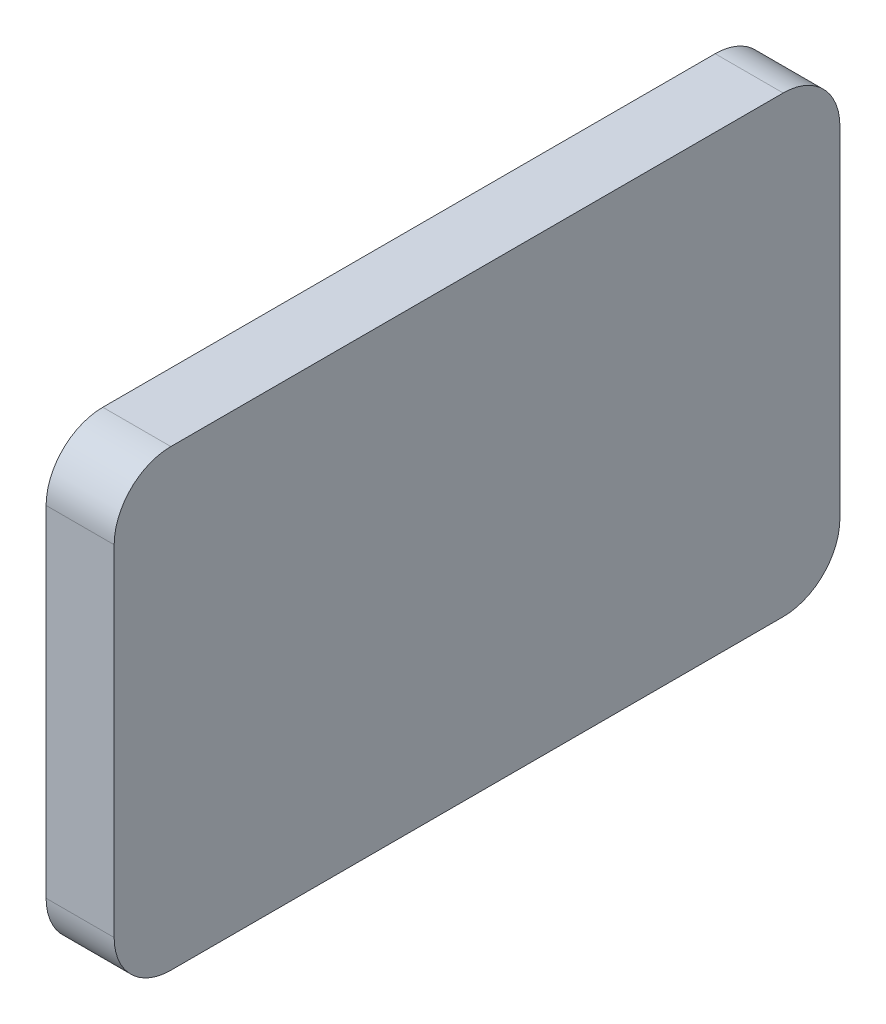
ISO-10303-21;
HEADER;
FILE_DESCRIPTION(('STEP AP214'),'2;1');
FILE_NAME('part.step','',(''),(''),'','','');
FILE_SCHEMA(('AUTOMOTIVE_DESIGN { 1 0 10303 214 1 1 1 1 }'));
ENDSEC;
DATA;
#1=APPLICATION_CONTEXT('core data for automotive mechanical design processes');
#2=APPLICATION_PROTOCOL_DEFINITION('international standard','automotive_design',2000,#1);
#3=PRODUCT_CONTEXT('',#1,'mechanical');
#4=PRODUCT('Part','Part','',(#3));
#5=PRODUCT_RELATED_PRODUCT_CATEGORY('part','',(#4));
#6=PRODUCT_DEFINITION_FORMATION('','',#4);
#7=PRODUCT_DEFINITION_CONTEXT('part definition',#1,'design');
#8=PRODUCT_DEFINITION('design','',#6,#7);
#9=PRODUCT_DEFINITION_SHAPE('','',#8);
#10=(LENGTH_UNIT() NAMED_UNIT(*) SI_UNIT(.MILLI.,.METRE.));
#11=(NAMED_UNIT(*) PLANE_ANGLE_UNIT() SI_UNIT($,.RADIAN.));
#12=(NAMED_UNIT(*) SI_UNIT($,.STERADIAN.) SOLID_ANGLE_UNIT());
#13=UNCERTAINTY_MEASURE_WITH_UNIT(LENGTH_MEASURE(1.E-05),#10,'distance_accuracy_value','');
#14=(GEOMETRIC_REPRESENTATION_CONTEXT(3) GLOBAL_UNCERTAINTY_ASSIGNED_CONTEXT((#13)) GLOBAL_UNIT_ASSIGNED_CONTEXT((#10,
#11,#12)) REPRESENTATION_CONTEXT('',''));
#15=CARTESIAN_POINT('',(0.,0.,0.));
#16=DIRECTION('',(0.,0.,1.));
#17=DIRECTION('',(1.,0.,0.));
#18=AXIS2_PLACEMENT_3D('',#15,#16,#17);
#19=CARTESIAN_POINT('',(6.,15.,-27.));
#20=DIRECTION('',(-1.,0.,0.));
#21=DIRECTION('',(0.,0.,1.));
#22=AXIS2_PLACEMENT_3D('',#19,#20,#21);
#23=CYLINDRICAL_SURFACE('',#22,5.00000000000001);
#24=CARTESIAN_POINT('',(0.,15.,-27.));
#25=DIRECTION('',(1.,0.,0.));
#26=DIRECTION('',(0.,0.,1.));
#27=AXIS2_PLACEMENT_3D('',#24,#25,#26);
#28=CIRCLE('',#27,5.00000000000001);
#29=CARTESIAN_POINT('',(0.,15.,-32.));
#30=VERTEX_POINT('',#29);
#31=CARTESIAN_POINT('',(0.,20.,-27.));
#32=VERTEX_POINT('',#31);
#33=EDGE_CURVE('E131',#30,#32,#28,.T.);
#34=ORIENTED_EDGE('',*,*,#33,.T.);
#35=DIRECTION('',(-1.,0.,0.));
#36=VECTOR('',#35,1.);
#37=CARTESIAN_POINT('',(6.,20.,-27.));
#38=LINE('',#37,#36);
#39=CARTESIAN_POINT('',(6.,20.,-27.));
#40=VERTEX_POINT('',#39);
#41=EDGE_CURVE('E11',#40,#32,#38,.T.);
#42=ORIENTED_EDGE('',*,*,#41,.F.);
#43=CARTESIAN_POINT('',(6.,15.,-27.));
#44=DIRECTION('',(1.,0.,0.));
#45=DIRECTION('',(0.,0.,1.));
#46=AXIS2_PLACEMENT_3D('',#43,#44,#45);
#47=CIRCLE('',#46,5.00000000000001);
#48=CARTESIAN_POINT('',(6.,15.,-32.));
#49=VERTEX_POINT('',#48);
#50=EDGE_CURVE('E145',#49,#40,#47,.T.);
#51=ORIENTED_EDGE('',*,*,#50,.F.);
#52=DIRECTION('',(-1.,0.,0.));
#53=VECTOR('',#52,1.);
#54=CARTESIAN_POINT('',(6.,15.,-32.));
#55=LINE('',#54,#53);
#56=EDGE_CURVE('E127',#49,#30,#55,.T.);
#57=ORIENTED_EDGE('',*,*,#56,.T.);
#58=EDGE_LOOP('',(#34,#42,#51,#57));
#59=FACE_BOUND('',#58,.T.);
#60=ADVANCED_FACE('F35',(#59),#23,.T.);
#61=CARTESIAN_POINT('',(6.,20.,27.));
#62=DIRECTION('',(0.,-1.,0.));
#63=DIRECTION('',(0.,0.,-1.));
#64=AXIS2_PLACEMENT_3D('',#61,#62,#63);
#65=PLANE('',#64);
#66=DIRECTION('',(0.,0.,1.));
#67=VECTOR('',#66,1.);
#68=CARTESIAN_POINT('',(0.,20.,27.));
#69=LINE('',#68,#67);
#70=CARTESIAN_POINT('',(0.,20.,27.));
#71=VERTEX_POINT('',#70);
#72=EDGE_CURVE('E134',#32,#71,#69,.T.);
#73=ORIENTED_EDGE('',*,*,#72,.T.);
#74=DIRECTION('',(-1.,0.,0.));
#75=VECTOR('',#74,1.);
#76=CARTESIAN_POINT('',(6.,20.,27.));
#77=LINE('',#76,#75);
#78=CARTESIAN_POINT('',(6.,20.,27.));
#79=VERTEX_POINT('',#78);
#80=EDGE_CURVE('E43',#79,#71,#77,.T.);
#81=ORIENTED_EDGE('',*,*,#80,.F.);
#82=DIRECTION('',(0.,0.,1.));
#83=VECTOR('',#82,1.);
#84=CARTESIAN_POINT('',(6.,20.,27.));
#85=LINE('',#84,#83);
#86=EDGE_CURVE('E94',#40,#79,#85,.T.);
#87=ORIENTED_EDGE('',*,*,#86,.F.);
#88=ORIENTED_EDGE('',*,*,#41,.T.);
#89=EDGE_LOOP('',(#73,#81,#87,#88));
#90=FACE_BOUND('',#89,.T.);
#91=ADVANCED_FACE('F180',(#90),#65,.F.);
#92=CARTESIAN_POINT('',(6.,15.,27.));
#93=DIRECTION('',(-1.,0.,0.));
#94=DIRECTION('',(0.,0.,1.));
#95=AXIS2_PLACEMENT_3D('',#92,#93,#94);
#96=CYLINDRICAL_SURFACE('',#95,5.);
#97=CARTESIAN_POINT('',(0.,15.,27.));
#98=DIRECTION('',(1.,0.,0.));
#99=DIRECTION('',(0.,0.,1.));
#100=AXIS2_PLACEMENT_3D('',#97,#98,#99);
#101=CIRCLE('',#100,5.);
#102=CARTESIAN_POINT('',(0.,15.,32.));
#103=VERTEX_POINT('',#102);
#104=EDGE_CURVE('E136',#71,#103,#101,.T.);
#105=ORIENTED_EDGE('',*,*,#104,.T.);
#106=DIRECTION('',(-1.,0.,0.));
#107=VECTOR('',#106,1.);
#108=CARTESIAN_POINT('',(6.,15.,32.));
#109=LINE('',#108,#107);
#110=CARTESIAN_POINT('',(6.,15.,32.));
#111=VERTEX_POINT('',#110);
#112=EDGE_CURVE('E152',#111,#103,#109,.T.);
#113=ORIENTED_EDGE('',*,*,#112,.F.);
#114=CARTESIAN_POINT('',(6.,15.,27.));
#115=DIRECTION('',(1.,0.,0.));
#116=DIRECTION('',(0.,0.,1.));
#117=AXIS2_PLACEMENT_3D('',#114,#115,#116);
#118=CIRCLE('',#117,5.);
#119=EDGE_CURVE('E160',#79,#111,#118,.T.);
#120=ORIENTED_EDGE('',*,*,#119,.F.);
#121=ORIENTED_EDGE('',*,*,#80,.T.);
#122=EDGE_LOOP('',(#105,#113,#120,#121));
#123=FACE_BOUND('',#122,.T.);
#124=ADVANCED_FACE('F158',(#123),#96,.T.);
#125=CARTESIAN_POINT('',(6.,15.,32.));
#126=DIRECTION('',(0.,0.,-1.));
#127=DIRECTION('',(-1.,0.,0.));
#128=AXIS2_PLACEMENT_3D('',#125,#126,#127);
#129=PLANE('',#128);
#130=DIRECTION('',(0.,-1.,0.));
#131=VECTOR('',#130,1.);
#132=CARTESIAN_POINT('',(0.,15.,32.));
#133=LINE('',#132,#131);
#134=CARTESIAN_POINT('',(0.,-15.,32.));
#135=VERTEX_POINT('',#134);
#136=EDGE_CURVE('E138',#103,#135,#133,.T.);
#137=ORIENTED_EDGE('',*,*,#136,.T.);
#138=DIRECTION('',(-1.,0.,0.));
#139=VECTOR('',#138,1.);
#140=CARTESIAN_POINT('',(6.,-15.,32.));
#141=LINE('',#140,#139);
#142=CARTESIAN_POINT('',(6.,-15.,32.));
#143=VERTEX_POINT('',#142);
#144=EDGE_CURVE('E149',#143,#135,#141,.T.);
#145=ORIENTED_EDGE('',*,*,#144,.F.);
#146=DIRECTION('',(0.,-1.,0.));
#147=VECTOR('',#146,1.);
#148=CARTESIAN_POINT('',(6.,15.,32.));
#149=LINE('',#148,#147);
#150=EDGE_CURVE('E172',#111,#143,#149,.T.);
#151=ORIENTED_EDGE('',*,*,#150,.F.);
#152=ORIENTED_EDGE('',*,*,#112,.T.);
#153=EDGE_LOOP('',(#137,#145,#151,#152));
#154=FACE_BOUND('',#153,.T.);
#155=ADVANCED_FACE('F168',(#154),#129,.F.);
#156=CARTESIAN_POINT('',(6.,-15.,27.));
#157=DIRECTION('',(-1.,0.,0.));
#158=DIRECTION('',(0.,0.,1.));
#159=AXIS2_PLACEMENT_3D('',#156,#157,#158);
#160=CYLINDRICAL_SURFACE('',#159,5.);
#161=CARTESIAN_POINT('',(0.,-15.,27.));
#162=DIRECTION('',(1.,0.,0.));
#163=DIRECTION('',(0.,0.,1.));
#164=AXIS2_PLACEMENT_3D('',#161,#162,#163);
#165=CIRCLE('',#164,5.);
#166=CARTESIAN_POINT('',(0.,-20.,27.));
#167=VERTEX_POINT('',#166);
#168=EDGE_CURVE('E140',#135,#167,#165,.T.);
#169=ORIENTED_EDGE('',*,*,#168,.T.);
#170=DIRECTION('',(-1.,0.,0.));
#171=VECTOR('',#170,1.);
#172=CARTESIAN_POINT('',(6.,-20.,27.));
#173=LINE('',#172,#171);
#174=CARTESIAN_POINT('',(6.,-20.,27.));
#175=VERTEX_POINT('',#174);
#176=EDGE_CURVE('E122',#175,#167,#173,.T.);
#177=ORIENTED_EDGE('',*,*,#176,.F.);
#178=CARTESIAN_POINT('',(6.,-15.,27.));
#179=DIRECTION('',(1.,0.,0.));
#180=DIRECTION('',(0.,0.,1.));
#181=AXIS2_PLACEMENT_3D('',#178,#179,#180);
#182=CIRCLE('',#181,5.);
#183=EDGE_CURVE('E113',#143,#175,#182,.T.);
#184=ORIENTED_EDGE('',*,*,#183,.F.);
#185=ORIENTED_EDGE('',*,*,#144,.T.);
#186=EDGE_LOOP('',(#169,#177,#184,#185));
#187=FACE_BOUND('',#186,.T.);
#188=ADVANCED_FACE('F171',(#187),#160,.T.);
#189=CARTESIAN_POINT('',(6.,-20.,27.));
#190=DIRECTION('',(0.,1.,0.));
#191=DIRECTION('',(0.,0.,1.));
#192=AXIS2_PLACEMENT_3D('',#189,#190,#191);
#193=PLANE('',#192);
#194=DIRECTION('',(0.,0.,-1.));
#195=VECTOR('',#194,1.);
#196=CARTESIAN_POINT('',(0.,-20.,27.));
#197=LINE('',#196,#195);
#198=CARTESIAN_POINT('',(0.,-20.,-27.));
#199=VERTEX_POINT('',#198);
#200=EDGE_CURVE('E121',#167,#199,#197,.T.);
#201=ORIENTED_EDGE('',*,*,#200,.T.);
#202=DIRECTION('',(-1.,0.,0.));
#203=VECTOR('',#202,1.);
#204=CARTESIAN_POINT('',(6.,-20.,-27.));
#205=LINE('',#204,#203);
#206=CARTESIAN_POINT('',(6.,-20.,-27.));
#207=VERTEX_POINT('',#206);
#208=EDGE_CURVE('E118',#207,#199,#205,.T.);
#209=ORIENTED_EDGE('',*,*,#208,.F.);
#210=DIRECTION('',(0.,0.,-1.));
#211=VECTOR('',#210,1.);
#212=CARTESIAN_POINT('',(6.,-20.,27.));
#213=LINE('',#212,#211);
#214=EDGE_CURVE('E107',#175,#207,#213,.T.);
#215=ORIENTED_EDGE('',*,*,#214,.F.);
#216=ORIENTED_EDGE('',*,*,#176,.T.);
#217=EDGE_LOOP('',(#201,#209,#215,#216));
#218=FACE_BOUND('',#217,.T.);
#219=ADVANCED_FACE('F119',(#218),#193,.F.);
#220=CARTESIAN_POINT('',(6.,-15.,-27.));
#221=DIRECTION('',(-1.,0.,0.));
#222=DIRECTION('',(0.,0.,1.));
#223=AXIS2_PLACEMENT_3D('',#220,#221,#222);
#224=CYLINDRICAL_SURFACE('',#223,5.00000000000001);
#225=CARTESIAN_POINT('',(0.,-15.,-27.));
#226=DIRECTION('',(1.,0.,0.));
#227=DIRECTION('',(0.,0.,-1.));
#228=AXIS2_PLACEMENT_3D('',#225,#226,#227);
#229=CIRCLE('',#228,5.00000000000001);
#230=CARTESIAN_POINT('',(0.,-15.,-32.));
#231=VERTEX_POINT('',#230);
#232=EDGE_CURVE('E80',#199,#231,#229,.T.);
#233=ORIENTED_EDGE('',*,*,#232,.T.);
#234=DIRECTION('',(-1.,0.,0.));
#235=VECTOR('',#234,1.);
#236=CARTESIAN_POINT('',(6.,-15.,-32.));
#237=LINE('',#236,#235);
#238=CARTESIAN_POINT('',(6.,-15.,-32.));
#239=VERTEX_POINT('',#238);
#240=EDGE_CURVE('E123',#239,#231,#237,.T.);
#241=ORIENTED_EDGE('',*,*,#240,.F.);
#242=CARTESIAN_POINT('',(6.,-15.,-27.));
#243=DIRECTION('',(1.,0.,0.));
#244=DIRECTION('',(0.,0.,-1.));
#245=AXIS2_PLACEMENT_3D('',#242,#243,#244);
#246=CIRCLE('',#245,5.00000000000001);
#247=EDGE_CURVE('E111',#207,#239,#246,.T.);
#248=ORIENTED_EDGE('',*,*,#247,.F.);
#249=ORIENTED_EDGE('',*,*,#208,.T.);
#250=EDGE_LOOP('',(#233,#241,#248,#249));
#251=FACE_BOUND('',#250,.T.);
#252=ADVANCED_FACE('F125',(#251),#224,.T.);
#253=CARTESIAN_POINT('',(6.,15.,-32.));
#254=DIRECTION('',(0.,0.,1.));
#255=DIRECTION('',(0.,-1.,0.));
#256=AXIS2_PLACEMENT_3D('',#253,#254,#255);
#257=PLANE('',#256);
#258=DIRECTION('',(0.,1.,0.));
#259=VECTOR('',#258,1.);
#260=CARTESIAN_POINT('',(0.,15.,-32.));
#261=LINE('',#260,#259);
#262=EDGE_CURVE('E86',#231,#30,#261,.T.);
#263=ORIENTED_EDGE('',*,*,#262,.T.);
#264=ORIENTED_EDGE('',*,*,#56,.F.);
#265=DIRECTION('',(0.,1.,0.));
#266=VECTOR('',#265,1.);
#267=CARTESIAN_POINT('',(6.,15.,-32.));
#268=LINE('',#267,#266);
#269=EDGE_CURVE('E51',#239,#49,#268,.T.);
#270=ORIENTED_EDGE('',*,*,#269,.F.);
#271=ORIENTED_EDGE('',*,*,#240,.T.);
#272=EDGE_LOOP('',(#263,#264,#270,#271));
#273=FACE_BOUND('',#272,.T.);
#274=ADVANCED_FACE('F196',(#273),#257,.F.);
#275=CARTESIAN_POINT('',(6.,15.,-27.));
#276=DIRECTION('',(-1.,0.,0.));
#277=DIRECTION('',(0.,0.,1.));
#278=AXIS2_PLACEMENT_3D('',#275,#276,#277);
#279=PLANE('',#278);
#280=ORIENTED_EDGE('',*,*,#50,.T.);
#281=ORIENTED_EDGE('',*,*,#86,.T.);
#282=ORIENTED_EDGE('',*,*,#119,.T.);
#283=ORIENTED_EDGE('',*,*,#150,.T.);
#284=ORIENTED_EDGE('',*,*,#183,.T.);
#285=ORIENTED_EDGE('',*,*,#214,.T.);
#286=ORIENTED_EDGE('',*,*,#247,.T.);
#287=ORIENTED_EDGE('',*,*,#269,.T.);
#288=EDGE_LOOP('',(#280,#281,#282,#283,#284,#285,#286,#287));
#289=FACE_BOUND('',#288,.T.);
#290=ADVANCED_FACE('F109',(#289),#279,.F.);
#291=CARTESIAN_POINT('',(0.,15.,-27.));
#292=DIRECTION('',(-1.,0.,0.));
#293=DIRECTION('',(0.,0.,1.));
#294=AXIS2_PLACEMENT_3D('',#291,#292,#293);
#295=PLANE('',#294);
#296=ORIENTED_EDGE('',*,*,#33,.F.);
#297=ORIENTED_EDGE('',*,*,#262,.F.);
#298=ORIENTED_EDGE('',*,*,#232,.F.);
#299=ORIENTED_EDGE('',*,*,#200,.F.);
#300=ORIENTED_EDGE('',*,*,#168,.F.);
#301=ORIENTED_EDGE('',*,*,#136,.F.);
#302=ORIENTED_EDGE('',*,*,#104,.F.);
#303=ORIENTED_EDGE('',*,*,#72,.F.);
#304=EDGE_LOOP('',(#296,#297,#298,#299,#300,#301,#302,#303));
#305=FACE_BOUND('',#304,.T.);
#306=ADVANCED_FACE('F164',(#305),#295,.T.);
#307=CLOSED_SHELL('',(#60,#91,#124,#155,#188,#219,#252,#274,#290,#306));
#308=MANIFOLD_SOLID_BREP('B2',#307);
#309=ADVANCED_BREP_SHAPE_REPRESENTATION('',(#18,#308),#14);
#310=SHAPE_DEFINITION_REPRESENTATION(#9,#309);
ENDSEC;
END-ISO-10303-21;
